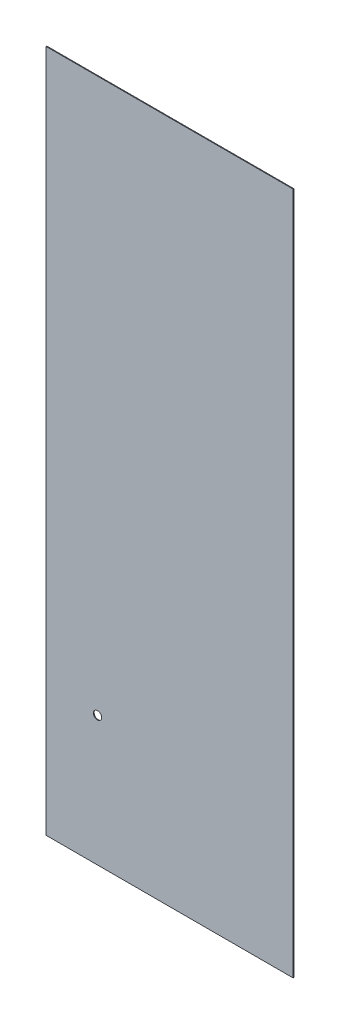
ISO-10303-21;
HEADER;
FILE_DESCRIPTION(('STEP AP214'),'2;1');
FILE_NAME('part.step','',(''),(''),'','','');
FILE_SCHEMA(('AUTOMOTIVE_DESIGN { 1 0 10303 214 1 1 1 1 }'));
ENDSEC;
DATA;
#1=APPLICATION_CONTEXT('core data for automotive mechanical design processes');
#2=APPLICATION_PROTOCOL_DEFINITION('international standard','automotive_design',2000,#1);
#3=PRODUCT_CONTEXT('',#1,'mechanical');
#4=PRODUCT('Part','Part','',(#3));
#5=PRODUCT_RELATED_PRODUCT_CATEGORY('part','',(#4));
#6=PRODUCT_DEFINITION_FORMATION('','',#4);
#7=PRODUCT_DEFINITION_CONTEXT('part definition',#1,'design');
#8=PRODUCT_DEFINITION('design','',#6,#7);
#9=PRODUCT_DEFINITION_SHAPE('','',#8);
#10=(LENGTH_UNIT() NAMED_UNIT(*) SI_UNIT(.MILLI.,.METRE.));
#11=(NAMED_UNIT(*) PLANE_ANGLE_UNIT() SI_UNIT($,.RADIAN.));
#12=(NAMED_UNIT(*) SI_UNIT($,.STERADIAN.) SOLID_ANGLE_UNIT());
#13=UNCERTAINTY_MEASURE_WITH_UNIT(LENGTH_MEASURE(1.E-05),#10,'distance_accuracy_value','');
#14=(GEOMETRIC_REPRESENTATION_CONTEXT(3) GLOBAL_UNCERTAINTY_ASSIGNED_CONTEXT((#13)) GLOBAL_UNIT_ASSIGNED_CONTEXT((#10,
#11,#12)) REPRESENTATION_CONTEXT('',''));
#15=CARTESIAN_POINT('',(0.,0.,0.));
#16=DIRECTION('',(0.,0.,1.));
#17=DIRECTION('',(1.,0.,0.));
#18=AXIS2_PLACEMENT_3D('',#15,#16,#17);
#19=CARTESIAN_POINT('',(0.,0.,-0.7));
#20=DIRECTION('',(-1.,0.,0.));
#21=DIRECTION('',(0.,0.,1.));
#22=AXIS2_PLACEMENT_3D('',#19,#20,#21);
#23=PLANE('',#22);
#24=DIRECTION('',(0.,-1.,0.));
#25=VECTOR('',#24,1.);
#26=CARTESIAN_POINT('',(0.,0.,0.));
#27=LINE('',#26,#25);
#28=CARTESIAN_POINT('',(0.,663.4,0.));
#29=VERTEX_POINT('',#28);
#30=CARTESIAN_POINT('',(0.,0.,0.));
#31=VERTEX_POINT('',#30);
#32=EDGE_CURVE('E106',#29,#31,#27,.T.);
#33=ORIENTED_EDGE('',*,*,#32,.F.);
#34=DIRECTION('',(0.,0.,1.));
#35=VECTOR('',#34,1.);
#36=CARTESIAN_POINT('',(0.,663.4,-0.7));
#37=LINE('',#36,#35);
#38=CARTESIAN_POINT('',(0.,663.4,-0.7));
#39=VERTEX_POINT('',#38);
#40=EDGE_CURVE('E11',#39,#29,#37,.T.);
#41=ORIENTED_EDGE('',*,*,#40,.F.);
#42=DIRECTION('',(0.,-1.,0.));
#43=VECTOR('',#42,1.);
#44=CARTESIAN_POINT('',(0.,0.,-0.7));
#45=LINE('',#44,#43);
#46=CARTESIAN_POINT('',(0.,0.,-0.7));
#47=VERTEX_POINT('',#46);
#48=EDGE_CURVE('E99',#39,#47,#45,.T.);
#49=ORIENTED_EDGE('',*,*,#48,.T.);
#50=DIRECTION('',(0.,0.,1.));
#51=VECTOR('',#50,1.);
#52=CARTESIAN_POINT('',(0.,0.,-0.7));
#53=LINE('',#52,#51);
#54=EDGE_CURVE('E82',#47,#31,#53,.T.);
#55=ORIENTED_EDGE('',*,*,#54,.T.);
#56=EDGE_LOOP('',(#33,#41,#49,#55));
#57=FACE_BOUND('',#56,.T.);
#58=ADVANCED_FACE('F39',(#57),#23,.T.);
#59=CARTESIAN_POINT('',(0.,663.4,-0.7));
#60=DIRECTION('',(0.,1.,0.));
#61=DIRECTION('',(0.,0.,1.));
#62=AXIS2_PLACEMENT_3D('',#59,#60,#61);
#63=PLANE('',#62);
#64=DIRECTION('',(-1.,0.,0.));
#65=VECTOR('',#64,1.);
#66=CARTESIAN_POINT('',(0.,663.4,0.));
#67=LINE('',#66,#65);
#68=CARTESIAN_POINT('',(240.,663.4,0.));
#69=VERTEX_POINT('',#68);
#70=EDGE_CURVE('E101',#69,#29,#67,.T.);
#71=ORIENTED_EDGE('',*,*,#70,.F.);
#72=DIRECTION('',(0.,0.,1.));
#73=VECTOR('',#72,1.);
#74=CARTESIAN_POINT('',(240.,663.4,-0.7));
#75=LINE('',#74,#73);
#76=CARTESIAN_POINT('',(240.,663.4,-0.7));
#77=VERTEX_POINT('',#76);
#78=EDGE_CURVE('E48',#77,#69,#75,.T.);
#79=ORIENTED_EDGE('',*,*,#78,.F.);
#80=DIRECTION('',(-1.,0.,0.));
#81=VECTOR('',#80,1.);
#82=CARTESIAN_POINT('',(0.,663.4,-0.7));
#83=LINE('',#82,#81);
#84=EDGE_CURVE('E96',#77,#39,#83,.T.);
#85=ORIENTED_EDGE('',*,*,#84,.T.);
#86=ORIENTED_EDGE('',*,*,#40,.T.);
#87=EDGE_LOOP('',(#71,#79,#85,#86));
#88=FACE_BOUND('',#87,.T.);
#89=ADVANCED_FACE('F116',(#88),#63,.T.);
#90=CARTESIAN_POINT('',(240.,0.,-0.7));
#91=DIRECTION('',(1.,0.,0.));
#92=DIRECTION('',(0.,0.,-1.));
#93=AXIS2_PLACEMENT_3D('',#90,#91,#92);
#94=PLANE('',#93);
#95=DIRECTION('',(0.,1.,0.));
#96=VECTOR('',#95,1.);
#97=CARTESIAN_POINT('',(240.,0.,0.));
#98=LINE('',#97,#96);
#99=CARTESIAN_POINT('',(240.,0.,0.));
#100=VERTEX_POINT('',#99);
#101=EDGE_CURVE('E90',#100,#69,#98,.T.);
#102=ORIENTED_EDGE('',*,*,#101,.F.);
#103=DIRECTION('',(0.,0.,1.));
#104=VECTOR('',#103,1.);
#105=CARTESIAN_POINT('',(240.,0.,-0.7));
#106=LINE('',#105,#104);
#107=CARTESIAN_POINT('',(240.,0.,-0.7));
#108=VERTEX_POINT('',#107);
#109=EDGE_CURVE('E85',#108,#100,#106,.T.);
#110=ORIENTED_EDGE('',*,*,#109,.F.);
#111=DIRECTION('',(0.,1.,0.));
#112=VECTOR('',#111,1.);
#113=CARTESIAN_POINT('',(240.,0.,-0.7));
#114=LINE('',#113,#112);
#115=EDGE_CURVE('E88',#108,#77,#114,.T.);
#116=ORIENTED_EDGE('',*,*,#115,.T.);
#117=ORIENTED_EDGE('',*,*,#78,.T.);
#118=EDGE_LOOP('',(#102,#110,#116,#117));
#119=FACE_BOUND('',#118,.T.);
#120=ADVANCED_FACE('F87',(#119),#94,.T.);
#121=CARTESIAN_POINT('',(0.,0.,-0.7));
#122=DIRECTION('',(0.,-1.,0.));
#123=DIRECTION('',(0.,0.,-1.));
#124=AXIS2_PLACEMENT_3D('',#121,#122,#123);
#125=PLANE('',#124);
#126=DIRECTION('',(1.,0.,0.));
#127=VECTOR('',#126,1.);
#128=CARTESIAN_POINT('',(0.,0.,0.));
#129=LINE('',#128,#127);
#130=EDGE_CURVE('E109',#31,#100,#129,.T.);
#131=ORIENTED_EDGE('',*,*,#130,.F.);
#132=ORIENTED_EDGE('',*,*,#54,.F.);
#133=DIRECTION('',(1.,0.,0.));
#134=VECTOR('',#133,1.);
#135=CARTESIAN_POINT('',(0.,0.,-0.7));
#136=LINE('',#135,#134);
#137=EDGE_CURVE('E95',#47,#108,#136,.T.);
#138=ORIENTED_EDGE('',*,*,#137,.T.);
#139=ORIENTED_EDGE('',*,*,#109,.T.);
#140=EDGE_LOOP('',(#131,#132,#138,#139));
#141=FACE_BOUND('',#140,.T.);
#142=ADVANCED_FACE('F98',(#141),#125,.T.);
#143=CARTESIAN_POINT('',(0.,0.,-0.7));
#144=DIRECTION('',(0.,0.,-1.));
#145=DIRECTION('',(-1.,0.,0.));
#146=AXIS2_PLACEMENT_3D('',#143,#144,#145);
#147=PLANE('',#146);
#148=CARTESIAN_POINT('',(50.,125.84,-0.7));
#149=DIRECTION('',(0.,0.,-1.));
#150=DIRECTION('',(-1.,0.,0.));
#151=AXIS2_PLACEMENT_3D('',#148,#149,#150);
#152=CIRCLE('',#151,4.00000000000001);
#153=CARTESIAN_POINT('',(46.,125.84,-0.7));
#154=VERTEX_POINT('',#153);
#155=EDGE_CURVE('E145',#154,#154,#152,.T.);
#156=ORIENTED_EDGE('',*,*,#155,.F.);
#157=EDGE_LOOP('',(#156));
#158=FACE_BOUND('',#157,.T.);
#159=ORIENTED_EDGE('',*,*,#48,.F.);
#160=ORIENTED_EDGE('',*,*,#84,.F.);
#161=ORIENTED_EDGE('',*,*,#115,.F.);
#162=ORIENTED_EDGE('',*,*,#137,.F.);
#163=EDGE_LOOP('',(#159,#160,#161,#162));
#164=FACE_BOUND('',#163,.T.);
#165=ADVANCED_FACE('F94',(#158,#164),#147,.T.);
#166=CARTESIAN_POINT('',(0.,0.,0.));
#167=DIRECTION('',(0.,0.,-1.));
#168=DIRECTION('',(-1.,0.,0.));
#169=AXIS2_PLACEMENT_3D('',#166,#167,#168);
#170=PLANE('',#169);
#171=CARTESIAN_POINT('',(50.,125.84,0.));
#172=DIRECTION('',(0.,0.,-1.));
#173=DIRECTION('',(-1.,0.,0.));
#174=AXIS2_PLACEMENT_3D('',#171,#172,#173);
#175=CIRCLE('',#174,4.00000000000001);
#176=CARTESIAN_POINT('',(46.,125.84,0.));
#177=VERTEX_POINT('',#176);
#178=EDGE_CURVE('E42',#177,#177,#175,.T.);
#179=ORIENTED_EDGE('',*,*,#178,.T.);
#180=EDGE_LOOP('',(#179));
#181=FACE_BOUND('',#180,.T.);
#182=ORIENTED_EDGE('',*,*,#32,.T.);
#183=ORIENTED_EDGE('',*,*,#130,.T.);
#184=ORIENTED_EDGE('',*,*,#101,.T.);
#185=ORIENTED_EDGE('',*,*,#70,.T.);
#186=EDGE_LOOP('',(#182,#183,#184,#185));
#187=FACE_BOUND('',#186,.T.);
#188=ADVANCED_FACE('F115',(#181,#187),#170,.F.);
#189=CARTESIAN_POINT('',(50.,125.84,9.3));
#190=DIRECTION('',(0.,0.,-1.));
#191=DIRECTION('',(-1.,0.,0.));
#192=AXIS2_PLACEMENT_3D('',#189,#190,#191);
#193=CYLINDRICAL_SURFACE('',#192,4.00000000000001);
#194=ORIENTED_EDGE('',*,*,#155,.T.);
#195=EDGE_LOOP('',(#194));
#196=FACE_BOUND('',#195,.T.);
#197=ORIENTED_EDGE('',*,*,#178,.F.);
#198=EDGE_LOOP('',(#197));
#199=FACE_BOUND('',#198,.T.);
#200=ADVANCED_FACE('F134',(#196,#199),#193,.F.);
#201=CLOSED_SHELL('',(#58,#89,#120,#142,#165,#188,#200));
#202=MANIFOLD_SOLID_BREP('B2',#201);
#203=ADVANCED_BREP_SHAPE_REPRESENTATION('',(#18,#202),#14);
#204=SHAPE_DEFINITION_REPRESENTATION(#9,#203);
ENDSEC;
END-ISO-10303-21;
